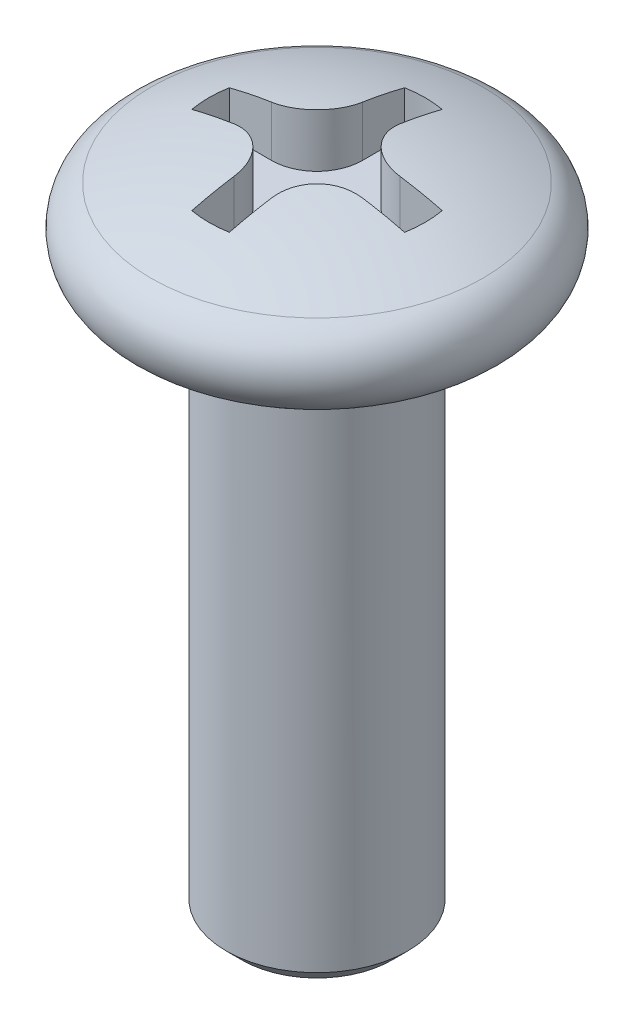
ISO-10303-21;
HEADER;
FILE_DESCRIPTION(('STEP AP214'),'2;1');
FILE_NAME('part.step','',(''),(''),'','','');
FILE_SCHEMA(('AUTOMOTIVE_DESIGN { 1 0 10303 214 1 1 1 1 }'));
ENDSEC;
DATA;
#1=APPLICATION_CONTEXT('core data for automotive mechanical design processes');
#2=APPLICATION_PROTOCOL_DEFINITION('international standard','automotive_design',2000,#1);
#3=PRODUCT_CONTEXT('',#1,'mechanical');
#4=PRODUCT('Part','Part','',(#3));
#5=PRODUCT_RELATED_PRODUCT_CATEGORY('part','',(#4));
#6=PRODUCT_DEFINITION_FORMATION('','',#4);
#7=PRODUCT_DEFINITION_CONTEXT('part definition',#1,'design');
#8=PRODUCT_DEFINITION('design','',#6,#7);
#9=PRODUCT_DEFINITION_SHAPE('','',#8);
#10=(LENGTH_UNIT() NAMED_UNIT(*) SI_UNIT(.MILLI.,.METRE.));
#11=(NAMED_UNIT(*) PLANE_ANGLE_UNIT() SI_UNIT($,.RADIAN.));
#12=(NAMED_UNIT(*) SI_UNIT($,.STERADIAN.) SOLID_ANGLE_UNIT());
#13=UNCERTAINTY_MEASURE_WITH_UNIT(LENGTH_MEASURE(1.E-05),#10,'distance_accuracy_value','');
#14=(GEOMETRIC_REPRESENTATION_CONTEXT(3) GLOBAL_UNCERTAINTY_ASSIGNED_CONTEXT((#13)) GLOBAL_UNIT_ASSIGNED_CONTEXT((#10,
#11,#12)) REPRESENTATION_CONTEXT('',''));
#15=CARTESIAN_POINT('',(0.,0.,0.));
#16=DIRECTION('',(0.,0.,1.));
#17=DIRECTION('',(1.,0.,0.));
#18=AXIS2_PLACEMENT_3D('',#15,#16,#17);
#19=CARTESIAN_POINT('',(0.,0.8,0.));
#20=DIRECTION('',(0.,-1.,0.));
#21=DIRECTION('',(0.,0.,-1.));
#22=AXIS2_PLACEMENT_3D('',#19,#20,#21);
#23=PLANE('',#22);
#24=DIRECTION('',(0.,0.,1.));
#25=VECTOR('',#24,1.);
#26=CARTESIAN_POINT('',(-0.2692388155425,0.8,1.526437178598));
#27=LINE('',#26,#25);
#28=CARTESIAN_POINT('',(-0.2692388155425,0.8,0.9192388155425));
#29=VERTEX_POINT('',#28);
#30=CARTESIAN_POINT('',(-0.2692388155425,0.8,1.52643717859784));
#31=VERTEX_POINT('',#30);
#32=EDGE_CURVE('E158',#29,#31,#27,.T.);
#33=ORIENTED_EDGE('',*,*,#32,.T.);
#34=CARTESIAN_POINT('',(0.,0.8,0.));
#35=DIRECTION('',(0.,-1.,0.));
#36=DIRECTION('',(0.,0.,-1.));
#37=AXIS2_PLACEMENT_3D('',#34,#35,#36);
#38=CIRCLE('',#37,1.55);
#39=CARTESIAN_POINT('',(0.269238815542473,0.8,1.52643717859769));
#40=VERTEX_POINT('',#39);
#41=EDGE_CURVE('E230',#31,#40,#38,.F.);
#42=ORIENTED_EDGE('',*,*,#41,.T.);
#43=DIRECTION('',(0.,0.,-1.));
#44=VECTOR('',#43,1.);
#45=CARTESIAN_POINT('',(0.2692388155425,0.8,0.9192388155425));
#46=LINE('',#45,#44);
#47=CARTESIAN_POINT('',(0.2692388155425,0.8,0.9192388155425));
#48=VERTEX_POINT('',#47);
#49=EDGE_CURVE('E162',#40,#48,#46,.T.);
#50=ORIENTED_EDGE('',*,*,#49,.T.);
#51=CARTESIAN_POINT('',(0.9192388155425,0.8,0.9192388155425));
#52=DIRECTION('',(0.,-1.,0.));
#53=DIRECTION('',(0.,0.,-1.));
#54=AXIS2_PLACEMENT_3D('',#51,#52,#53);
#55=CIRCLE('',#54,0.65);
#56=CARTESIAN_POINT('',(0.9192388155425,0.8,0.2692388155425));
#57=VERTEX_POINT('',#56);
#58=EDGE_CURVE('E165',#57,#48,#55,.F.);
#59=ORIENTED_EDGE('',*,*,#58,.F.);
#60=DIRECTION('',(1.,0.,0.));
#61=VECTOR('',#60,1.);
#62=CARTESIAN_POINT('',(1.526437178598,0.8,0.2692388155425));
#63=LINE('',#62,#61);
#64=CARTESIAN_POINT('',(1.52643717859784,0.8,0.2692388155425));
#65=VERTEX_POINT('',#64);
#66=EDGE_CURVE('E166',#57,#65,#63,.T.);
#67=ORIENTED_EDGE('',*,*,#66,.T.);
#68=CARTESIAN_POINT('',(0.,0.8,0.));
#69=DIRECTION('',(0.,-1.,0.));
#70=DIRECTION('',(0.,0.,-1.));
#71=AXIS2_PLACEMENT_3D('',#68,#69,#70);
#72=CIRCLE('',#71,1.55);
#73=CARTESIAN_POINT('',(1.52643717859769,0.8,-0.269238815542473));
#74=VERTEX_POINT('',#73);
#75=EDGE_CURVE('E241',#65,#74,#72,.F.);
#76=ORIENTED_EDGE('',*,*,#75,.T.);
#77=DIRECTION('',(-1.,0.,0.));
#78=VECTOR('',#77,1.);
#79=CARTESIAN_POINT('',(0.9192388155425,0.8,-0.2692388155425));
#80=LINE('',#79,#78);
#81=CARTESIAN_POINT('',(0.9192388155425,0.8,-0.2692388155425));
#82=VERTEX_POINT('',#81);
#83=EDGE_CURVE('E170',#74,#82,#80,.T.);
#84=ORIENTED_EDGE('',*,*,#83,.T.);
#85=CARTESIAN_POINT('',(0.9192388155425,0.8,-0.9192388155425));
#86=DIRECTION('',(0.,-1.,0.));
#87=DIRECTION('',(0.,0.,-1.));
#88=AXIS2_PLACEMENT_3D('',#85,#86,#87);
#89=CIRCLE('',#88,0.65);
#90=CARTESIAN_POINT('',(0.2692388155425,0.8,-0.9192388155425));
#91=VERTEX_POINT('',#90);
#92=EDGE_CURVE('E173',#91,#82,#89,.F.);
#93=ORIENTED_EDGE('',*,*,#92,.F.);
#94=DIRECTION('',(0.,0.,-1.));
#95=VECTOR('',#94,1.);
#96=CARTESIAN_POINT('',(0.2692388155425,0.8,-1.526437178598));
#97=LINE('',#96,#95);
#98=CARTESIAN_POINT('',(0.2692388155425,0.8,-1.52643717859784));
#99=VERTEX_POINT('',#98);
#100=EDGE_CURVE('E175',#91,#99,#97,.T.);
#101=ORIENTED_EDGE('',*,*,#100,.T.);
#102=CARTESIAN_POINT('',(0.,0.8,0.));
#103=DIRECTION('',(0.,-1.,0.));
#104=DIRECTION('',(0.,0.,-1.));
#105=AXIS2_PLACEMENT_3D('',#102,#103,#104);
#106=CIRCLE('',#105,1.55);
#107=CARTESIAN_POINT('',(-0.269238815542474,0.8,-1.52643717859769));
#108=VERTEX_POINT('',#107);
#109=EDGE_CURVE('E134',#99,#108,#106,.F.);
#110=ORIENTED_EDGE('',*,*,#109,.T.);
#111=DIRECTION('',(0.,0.,1.));
#112=VECTOR('',#111,1.);
#113=CARTESIAN_POINT('',(-0.2692388155425,0.8,-0.9192388155425));
#114=LINE('',#113,#112);
#115=CARTESIAN_POINT('',(-0.2692388155425,0.8,-0.9192388155425));
#116=VERTEX_POINT('',#115);
#117=EDGE_CURVE('E130',#108,#116,#114,.T.);
#118=ORIENTED_EDGE('',*,*,#117,.T.);
#119=CARTESIAN_POINT('',(-0.9192388155425,0.8,-0.9192388155425));
#120=DIRECTION('',(0.,-1.,0.));
#121=DIRECTION('',(0.,0.,-1.));
#122=AXIS2_PLACEMENT_3D('',#119,#120,#121);
#123=CIRCLE('',#122,0.65);
#124=CARTESIAN_POINT('',(-0.9192388155425,0.8,-0.2692388155425));
#125=VERTEX_POINT('',#124);
#126=EDGE_CURVE('E18',#125,#116,#123,.F.);
#127=ORIENTED_EDGE('',*,*,#126,.F.);
#128=DIRECTION('',(-1.,0.,0.));
#129=VECTOR('',#128,1.);
#130=CARTESIAN_POINT('',(-1.526437178598,0.8,-0.2692388155425));
#131=LINE('',#130,#129);
#132=CARTESIAN_POINT('',(-1.52643717859769,0.8,-0.269238815542473));
#133=VERTEX_POINT('',#132);
#134=EDGE_CURVE('E125',#125,#133,#131,.T.);
#135=ORIENTED_EDGE('',*,*,#134,.T.);
#136=CARTESIAN_POINT('',(0.,0.8,0.));
#137=DIRECTION('',(0.,-1.,0.));
#138=DIRECTION('',(0.,0.,-1.));
#139=AXIS2_PLACEMENT_3D('',#136,#137,#138);
#140=CIRCLE('',#139,1.55);
#141=CARTESIAN_POINT('',(-1.52643717859784,0.8,0.2692388155425));
#142=VERTEX_POINT('',#141);
#143=EDGE_CURVE('E238',#133,#142,#140,.F.);
#144=ORIENTED_EDGE('',*,*,#143,.T.);
#145=DIRECTION('',(1.,0.,0.));
#146=VECTOR('',#145,1.);
#147=CARTESIAN_POINT('',(-0.9192388155425,0.8,0.2692388155425));
#148=LINE('',#147,#146);
#149=CARTESIAN_POINT('',(-0.9192388155425,0.8,0.2692388155425));
#150=VERTEX_POINT('',#149);
#151=EDGE_CURVE('E155',#142,#150,#148,.T.);
#152=ORIENTED_EDGE('',*,*,#151,.T.);
#153=CARTESIAN_POINT('',(-0.9192388155425,0.8,0.9192388155425));
#154=DIRECTION('',(0.,-1.,0.));
#155=DIRECTION('',(0.,0.,-1.));
#156=AXIS2_PLACEMENT_3D('',#153,#154,#155);
#157=CIRCLE('',#156,0.65);
#158=EDGE_CURVE('E224',#29,#150,#157,.F.);
#159=ORIENTED_EDGE('',*,*,#158,.F.);
#160=EDGE_LOOP('',(#33,#42,#50,#59,#67,#76,#84,#93,#101,#110,#118,#127,#135,#144,#152,#159));
#161=FACE_BOUND('',#160,.T.);
#162=ADVANCED_FACE('F15',(#161),#23,.F.);
#163=CARTESIAN_POINT('',(-1.526437178598,0.8,-0.2692388155425));
#164=DIRECTION('',(0.,0.,-1.));
#165=DIRECTION('',(-1.,0.,0.));
#166=AXIS2_PLACEMENT_3D('',#163,#164,#165);
#167=PLANE('',#166);
#168=ORIENTED_EDGE('',*,*,#134,.F.);
#169=DIRECTION('',(0.,-1.,0.));
#170=VECTOR('',#169,1.);
#171=CARTESIAN_POINT('',(-0.9192388155425,0.8,-0.2692388155425));
#172=LINE('',#171,#170);
#173=CARTESIAN_POINT('',(-0.919238815542485,1.5247137721749,-0.269238815542501));
#174=VERTEX_POINT('',#173);
#175=EDGE_CURVE('E144',#174,#125,#172,.T.);
#176=ORIENTED_EDGE('',*,*,#175,.F.);
#177=CARTESIAN_POINT('',(-1.52643717859784,1.40083405534686,-0.269238815542502));
#178=CARTESIAN_POINT('',(-1.42628258533272,1.42660341497324,-0.269238815542501));
#179=CARTESIAN_POINT('',(-1.3256054251122,1.44981140452209,-0.2692388155425));
#180=CARTESIAN_POINT('',(-1.12320597076041,1.49110464346474,-0.2692388155425));
#181=CARTESIAN_POINT('',(-1.02148367662913,1.50918989285854,-0.269238815542501));
#182=CARTESIAN_POINT('',(-0.919238815542471,1.52471377217481,-0.269238815542503));
#183=B_SPLINE_CURVE_WITH_KNOTS('',3,(#177,#178,#179,#180,#181,#182),.UNSPECIFIED.,.F.,.F.,(4,2,
4),(0.,0.309952435577939,0.619904871155877),.UNSPECIFIED.);
#184=CARTESIAN_POINT('',(-1.52643717859777,1.40083405534693,-0.269238815542474));
#185=VERTEX_POINT('',#184);
#186=EDGE_CURVE('E221',#185,#174,#183,.T.);
#187=ORIENTED_EDGE('',*,*,#186,.F.);
#188=DIRECTION('',(0.,-1.,0.));
#189=VECTOR('',#188,1.);
#190=CARTESIAN_POINT('',(-1.5264371785977,0.8,-0.269238815542447));
#191=LINE('',#190,#189);
#192=EDGE_CURVE('E236',#185,#133,#191,.T.);
#193=ORIENTED_EDGE('',*,*,#192,.T.);
#194=EDGE_LOOP('',(#168,#176,#187,#193));
#195=FACE_BOUND('',#194,.T.);
#196=ADVANCED_FACE('F279',(#195),#167,.F.);
#197=CARTESIAN_POINT('',(-0.9192388155425,0.8,-0.9192388155425));
#198=DIRECTION('',(0.,-1.,0.));
#199=DIRECTION('',(0.,0.,-1.));
#200=AXIS2_PLACEMENT_3D('',#197,#198,#199);
#201=CYLINDRICAL_SURFACE('',#200,0.65);
#202=DIRECTION('',(0.,1.,0.));
#203=VECTOR('',#202,1.);
#204=CARTESIAN_POINT('',(-0.2692388155425,0.8,-0.9192388155425));
#205=LINE('',#204,#203);
#206=CARTESIAN_POINT('',(-0.269238815542499,1.5247137721749,-0.9192388155425));
#207=VERTEX_POINT('',#206);
#208=EDGE_CURVE('E138',#116,#207,#205,.T.);
#209=ORIENTED_EDGE('',*,*,#208,.T.);
#210=CARTESIAN_POINT('',(-0.919238815542471,1.52471377217481,-0.269238815542502));
#211=CARTESIAN_POINT('',(-0.883271069284547,1.53017838215662,-0.269206596368221));
#212=CARTESIAN_POINT('',(-0.847230957030022,1.53518398680924,-0.272222835690411));
#213=CARTESIAN_POINT('',(-0.776024482266567,1.54415362187526,-0.284194183766013));
#214=CARTESIAN_POINT('',(-0.740857976412674,1.5481178242021,-0.293148311438722));
#215=CARTESIAN_POINT('',(-0.67237147630745,1.55488625546089,-0.316848960302737));
#216=CARTESIAN_POINT('',(-0.639053304502208,1.55768935656103,-0.331601086387425));
#217=CARTESIAN_POINT('',(-0.575297778798748,1.56204492956572,-0.366496760027211));
#218=CARTESIAN_POINT('',(-0.544859240050173,1.56359791783258,-0.386638076978003));
#219=CARTESIAN_POINT('',(-0.488097063461274,1.56539571440067,-0.431479043245953));
#220=CARTESIAN_POINT('',(-0.46172860298219,1.56565593228317,-0.456121349806758));
#221=CARTESIAN_POINT('',(-0.413435525795813,1.56490196217992,-0.509414647326526));
#222=CARTESIAN_POINT('',(-0.391510799474461,1.56388780563375,-0.538065539375813));
#223=CARTESIAN_POINT('',(-0.352825154531402,1.56062536432746,-0.598376464130783));
#224=CARTESIAN_POINT('',(-0.33603703253758,1.55838376285363,-0.630019440211363));
#225=CARTESIAN_POINT('',(-0.307904881496572,1.55273696196925,-0.69554063304805));
#226=CARTESIAN_POINT('',(-0.296559537832556,1.54933204387991,-0.729418307797173));
#227=CARTESIAN_POINT('',(-0.281799832125994,1.54249219211062,-0.789390970708275));
#228=CARTESIAN_POINT('',(-0.277087023520738,1.53929822937966,-0.815202930682549));
#229=CARTESIAN_POINT('',(-0.270805742102409,1.53238664939424,-0.867099473917435));
#230=CARTESIAN_POINT('',(-0.269232761212042,1.52866979112439,-0.893183612184108));
#231=CARTESIAN_POINT('',(-0.269238815542499,1.5247137721748,-0.919238815542471));
#232=B_SPLINE_CURVE_WITH_KNOTS('',3,(#210,#211,#212,#213,#214,#215,#216,#217,#218,#219,#220,
#221,#222,#223,#224,#225,#226,#227,#228,#229,#230,#231),.UNSPECIFIED.,.F.,.F.,(4,2,2,2,2,2,2,2,
2,2,4),(0.,0.109017930799935,0.218017853725243,0.327123406477721,0.436183869743588,
0.543941180487167,0.651695832846214,0.758869525629321,0.866017319256542,0.945129051904781,
1.02412711619082),.UNSPECIFIED.);
#233=EDGE_CURVE('E263',#174,#207,#232,.T.);
#234=ORIENTED_EDGE('',*,*,#233,.F.);
#235=ORIENTED_EDGE('',*,*,#175,.T.);
#236=ORIENTED_EDGE('',*,*,#126,.T.);
#237=EDGE_LOOP('',(#209,#234,#235,#236));
#238=FACE_BOUND('',#237,.T.);
#239=ADVANCED_FACE('F141',(#238),#201,.T.);
#240=CARTESIAN_POINT('',(-0.2692388155425,0.8,-0.9192388155425));
#241=DIRECTION('',(-1.,0.,0.));
#242=DIRECTION('',(0.,0.,1.));
#243=AXIS2_PLACEMENT_3D('',#240,#241,#242);
#244=PLANE('',#243);
#245=ORIENTED_EDGE('',*,*,#117,.F.);
#246=DIRECTION('',(0.,-1.,0.));
#247=VECTOR('',#246,1.);
#248=CARTESIAN_POINT('',(-0.269238815542447,0.8,-1.5264371785977));
#249=LINE('',#248,#247);
#250=CARTESIAN_POINT('',(-0.269238815542499,1.40083405534695,-1.5264371785976));
#251=VERTEX_POINT('',#250);
#252=EDGE_CURVE('E150',#108,#251,#249,.F.);
#253=ORIENTED_EDGE('',*,*,#252,.T.);
#254=CARTESIAN_POINT('',(-0.269238815542499,-4.530985590341,0.));
#255=DIRECTION('',(-1.,0.,0.));
#256=DIRECTION('',(0.,0.,1.));
#257=AXIS2_PLACEMENT_3D('',#254,#255,#256);
#258=CIRCLE('',#257,6.12507100115372);
#259=EDGE_CURVE('E147',#207,#251,#258,.T.);
#260=ORIENTED_EDGE('',*,*,#259,.F.);
#261=ORIENTED_EDGE('',*,*,#208,.F.);
#262=EDGE_LOOP('',(#245,#253,#260,#261));
#263=FACE_BOUND('',#262,.T.);
#264=ADVANCED_FACE('F145',(#263),#244,.F.);
#265=CARTESIAN_POINT('',(0.,0.8,0.));
#266=DIRECTION('',(0.,-1.,0.));
#267=DIRECTION('',(0.,0.,-1.));
#268=AXIS2_PLACEMENT_3D('',#265,#266,#267);
#269=CYLINDRICAL_SURFACE('',#268,1.55);
#270=ORIENTED_EDGE('',*,*,#109,.F.);
#271=DIRECTION('',(0.,1.,0.));
#272=VECTOR('',#271,1.);
#273=CARTESIAN_POINT('',(0.2692388155425,0.8,-1.526437178598));
#274=LINE('',#273,#272);
#275=CARTESIAN_POINT('',(0.2692388155425,1.40083405534691,-1.52643717859775));
#276=VERTEX_POINT('',#275);
#277=EDGE_CURVE('E176',#99,#276,#274,.T.);
#278=ORIENTED_EDGE('',*,*,#277,.T.);
#279=CARTESIAN_POINT('',(0.,1.400834055347,0.));
#280=DIRECTION('',(0.,-1.,0.));
#281=DIRECTION('',(0.,0.,-1.));
#282=AXIS2_PLACEMENT_3D('',#279,#280,#281);
#283=CIRCLE('',#282,1.55);
#284=EDGE_CURVE('E251',#251,#276,#283,.T.);
#285=ORIENTED_EDGE('',*,*,#284,.F.);
#286=ORIENTED_EDGE('',*,*,#252,.F.);
#287=EDGE_LOOP('',(#270,#278,#285,#286));
#288=FACE_BOUND('',#287,.T.);
#289=ADVANCED_FACE('F249',(#288),#269,.F.);
#290=CARTESIAN_POINT('',(0.2692388155425,0.8,-1.526437178598));
#291=DIRECTION('',(1.,0.,0.));
#292=DIRECTION('',(0.,0.,-1.));
#293=AXIS2_PLACEMENT_3D('',#290,#291,#292);
#294=PLANE('',#293);
#295=ORIENTED_EDGE('',*,*,#100,.F.);
#296=DIRECTION('',(0.,-1.,0.));
#297=VECTOR('',#296,1.);
#298=CARTESIAN_POINT('',(0.2692388155425,0.8,-0.9192388155425));
#299=LINE('',#298,#297);
#300=CARTESIAN_POINT('',(0.2692388155425,1.5247137721749,-0.9192388155425));
#301=VERTEX_POINT('',#300);
#302=EDGE_CURVE('E243',#301,#91,#299,.T.);
#303=ORIENTED_EDGE('',*,*,#302,.F.);
#304=CARTESIAN_POINT('',(0.2692388155425,-4.530985590341,0.));
#305=DIRECTION('',(-1.,0.,0.));
#306=DIRECTION('',(0.,0.,1.));
#307=AXIS2_PLACEMENT_3D('',#304,#305,#306);
#308=CIRCLE('',#307,6.12507100115372);
#309=EDGE_CURVE('E254',#276,#301,#308,.F.);
#310=ORIENTED_EDGE('',*,*,#309,.F.);
#311=ORIENTED_EDGE('',*,*,#277,.F.);
#312=EDGE_LOOP('',(#295,#303,#310,#311));
#313=FACE_BOUND('',#312,.T.);
#314=ADVANCED_FACE('F255',(#313),#294,.F.);
#315=CARTESIAN_POINT('',(0.9192388155425,0.8,-0.9192388155425));
#316=DIRECTION('',(0.,-1.,0.));
#317=DIRECTION('',(0.,0.,-1.));
#318=AXIS2_PLACEMENT_3D('',#315,#316,#317);
#319=CYLINDRICAL_SURFACE('',#318,0.65);
#320=DIRECTION('',(0.,1.,0.));
#321=VECTOR('',#320,1.);
#322=CARTESIAN_POINT('',(0.9192388155425,0.8,-0.2692388155425));
#323=LINE('',#322,#321);
#324=CARTESIAN_POINT('',(0.919238815542485,1.5247137721749,-0.269238815542501));
#325=VERTEX_POINT('',#324);
#326=EDGE_CURVE('E172',#82,#325,#323,.T.);
#327=ORIENTED_EDGE('',*,*,#326,.T.);
#328=CARTESIAN_POINT('',(0.2692388155425,1.5247137721748,-0.919238815542471));
#329=CARTESIAN_POINT('',(0.26920659636822,1.53017838215662,-0.883271069284549));
#330=CARTESIAN_POINT('',(0.27222283569041,1.53518398680924,-0.847230957030025));
#331=CARTESIAN_POINT('',(0.284194183766012,1.54415362187526,-0.776024482266574));
#332=CARTESIAN_POINT('',(0.29314831143872,1.5481178242021,-0.740857976412682));
#333=CARTESIAN_POINT('',(0.316848960302734,1.55488625546089,-0.672371476307461));
#334=CARTESIAN_POINT('',(0.33160108638742,1.55768935656103,-0.63905330450222));
#335=CARTESIAN_POINT('',(0.366496760027202,1.56204492956572,-0.575297778798761));
#336=CARTESIAN_POINT('',(0.386638076977991,1.56359791783258,-0.544859240050187));
#337=CARTESIAN_POINT('',(0.431479043245938,1.56539571440067,-0.488097063461288));
#338=CARTESIAN_POINT('',(0.456121349806743,1.56565593228317,-0.461728602982204));
#339=CARTESIAN_POINT('',(0.509414647326511,1.56490196217992,-0.413435525795826));
#340=CARTESIAN_POINT('',(0.538065539375799,1.56388780563376,-0.391510799474473));
#341=CARTESIAN_POINT('',(0.598376464130768,1.56062536432746,-0.352825154531412));
#342=CARTESIAN_POINT('',(0.630019440211347,1.55838376285363,-0.336037032537589));
#343=CARTESIAN_POINT('',(0.695540633048032,1.55273696196925,-0.307904881496577));
#344=CARTESIAN_POINT('',(0.729418307797154,1.54933204387992,-0.296559537832559));
#345=CARTESIAN_POINT('',(0.789390970708259,1.54249219211062,-0.281799832125995));
#346=CARTESIAN_POINT('',(0.815202930682536,1.53929822937967,-0.277087023520739));
#347=CARTESIAN_POINT('',(0.867099473917428,1.53238664939424,-0.270805742102411));
#348=CARTESIAN_POINT('',(0.893183612184104,1.52866979112439,-0.269232761212043));
#349=CARTESIAN_POINT('',(0.91923881554247,1.52471377217481,-0.269238815542501));
#350=B_SPLINE_CURVE_WITH_KNOTS('',3,(#328,#329,#330,#331,#332,#333,#334,#335,#336,#337,#338,
#339,#340,#341,#342,#343,#344,#345,#346,#347,#348,#349),.UNSPECIFIED.,.F.,.F.,(4,2,2,2,2,2,2,2,
2,2,4),(0.,0.10901793079993,0.218017853725233,0.327123406477707,0.436183869743568,
0.543941180487147,0.651695832846195,0.758869525629303,0.866017319256523,0.945129051904771,
1.02412711619082),.UNSPECIFIED.);
#351=EDGE_CURVE('E259',#301,#325,#350,.T.);
#352=ORIENTED_EDGE('',*,*,#351,.F.);
#353=ORIENTED_EDGE('',*,*,#302,.T.);
#354=ORIENTED_EDGE('',*,*,#92,.T.);
#355=EDGE_LOOP('',(#327,#352,#353,#354));
#356=FACE_BOUND('',#355,.T.);
#357=ADVANCED_FACE('F398',(#356),#319,.T.);
#358=CARTESIAN_POINT('',(0.9192388155425,0.8,-0.2692388155425));
#359=DIRECTION('',(0.,0.,-1.));
#360=DIRECTION('',(-1.,0.,0.));
#361=AXIS2_PLACEMENT_3D('',#358,#359,#360);
#362=PLANE('',#361);
#363=ORIENTED_EDGE('',*,*,#83,.F.);
#364=DIRECTION('',(0.,-1.,0.));
#365=VECTOR('',#364,1.);
#366=CARTESIAN_POINT('',(1.5264371785977,0.8,-0.269238815542447));
#367=LINE('',#366,#365);
#368=CARTESIAN_POINT('',(1.52643717859769,1.400834055347,-0.269238815542473));
#369=VERTEX_POINT('',#368);
#370=EDGE_CURVE('E169',#74,#369,#367,.F.);
#371=ORIENTED_EDGE('',*,*,#370,.T.);
#372=CARTESIAN_POINT('',(0.91923881554247,1.52471377217481,-0.269238815542502));
#373=CARTESIAN_POINT('',(1.02148367662913,1.50918989285854,-0.269238815542501));
#374=CARTESIAN_POINT('',(1.12320597076041,1.49110464346474,-0.2692388155425));
#375=CARTESIAN_POINT('',(1.3256054251122,1.44981140452209,-0.2692388155425));
#376=CARTESIAN_POINT('',(1.42628258533272,1.42660341497324,-0.269238815542501));
#377=CARTESIAN_POINT('',(1.52643717859784,1.40083405534686,-0.269238815542503));
#378=B_SPLINE_CURVE_WITH_KNOTS('',3,(#372,#373,#374,#375,#376,#377),.UNSPECIFIED.,.F.,.F.,(4,2,
4),(0.,0.309952435577939,0.619904871155879),.UNSPECIFIED.);
#379=EDGE_CURVE('E504',#325,#369,#378,.T.);
#380=ORIENTED_EDGE('',*,*,#379,.F.);
#381=ORIENTED_EDGE('',*,*,#326,.F.);
#382=EDGE_LOOP('',(#363,#371,#380,#381));
#383=FACE_BOUND('',#382,.T.);
#384=ADVANCED_FACE('F390',(#383),#362,.F.);
#385=CARTESIAN_POINT('',(0.,0.8,0.));
#386=DIRECTION('',(0.,-1.,0.));
#387=DIRECTION('',(0.,0.,-1.));
#388=AXIS2_PLACEMENT_3D('',#385,#386,#387);
#389=CYLINDRICAL_SURFACE('',#388,1.55);
#390=ORIENTED_EDGE('',*,*,#143,.F.);
#391=ORIENTED_EDGE('',*,*,#192,.F.);
#392=CARTESIAN_POINT('',(0.,1.400834055347,0.));
#393=DIRECTION('',(0.,-1.,0.));
#394=DIRECTION('',(0.,0.,-1.));
#395=AXIS2_PLACEMENT_3D('',#392,#393,#394);
#396=CIRCLE('',#395,1.55);
#397=CARTESIAN_POINT('',(-1.52643717859784,1.400834055347,0.2692388155425));
#398=VERTEX_POINT('',#397);
#399=EDGE_CURVE('E510',#398,#185,#396,.T.);
#400=ORIENTED_EDGE('',*,*,#399,.F.);
#401=DIRECTION('',(0.,1.,0.));
#402=VECTOR('',#401,1.);
#403=CARTESIAN_POINT('',(-1.526437178598,0.8,0.2692388155425));
#404=LINE('',#403,#402);
#405=EDGE_CURVE('E157',#398,#142,#404,.F.);
#406=ORIENTED_EDGE('',*,*,#405,.T.);
#407=EDGE_LOOP('',(#390,#391,#400,#406));
#408=FACE_BOUND('',#407,.T.);
#409=ADVANCED_FACE('F382',(#408),#389,.F.);
#410=CARTESIAN_POINT('',(0.,0.8,0.));
#411=DIRECTION('',(0.,-1.,0.));
#412=DIRECTION('',(0.,0.,-1.));
#413=AXIS2_PLACEMENT_3D('',#410,#411,#412);
#414=CYLINDRICAL_SURFACE('',#413,1.55);
#415=ORIENTED_EDGE('',*,*,#370,.F.);
#416=ORIENTED_EDGE('',*,*,#75,.F.);
#417=DIRECTION('',(0.,1.,0.));
#418=VECTOR('',#417,1.);
#419=CARTESIAN_POINT('',(1.526437178598,0.8,0.2692388155425));
#420=LINE('',#419,#418);
#421=CARTESIAN_POINT('',(1.52643717859795,1.40083405534692,0.269238815542498));
#422=VERTEX_POINT('',#421);
#423=EDGE_CURVE('E168',#65,#422,#420,.T.);
#424=ORIENTED_EDGE('',*,*,#423,.T.);
#425=CARTESIAN_POINT('',(0.,1.400834055347,0.));
#426=DIRECTION('',(0.,-1.,0.));
#427=DIRECTION('',(0.,0.,-1.));
#428=AXIS2_PLACEMENT_3D('',#425,#426,#427);
#429=CIRCLE('',#428,1.55);
#430=EDGE_CURVE('E512',#369,#422,#429,.T.);
#431=ORIENTED_EDGE('',*,*,#430,.F.);
#432=EDGE_LOOP('',(#415,#416,#424,#431));
#433=FACE_BOUND('',#432,.T.);
#434=ADVANCED_FACE('F374',(#433),#414,.F.);
#435=CARTESIAN_POINT('',(1.526437178598,0.8,0.2692388155425));
#436=DIRECTION('',(0.,0.,1.));
#437=DIRECTION('',(1.,0.,0.));
#438=AXIS2_PLACEMENT_3D('',#435,#436,#437);
#439=PLANE('',#438);
#440=ORIENTED_EDGE('',*,*,#66,.F.);
#441=DIRECTION('',(0.,-1.,0.));
#442=VECTOR('',#441,1.);
#443=CARTESIAN_POINT('',(0.9192388155425,0.8,0.2692388155425));
#444=LINE('',#443,#442);
#445=CARTESIAN_POINT('',(0.919238815542485,1.5247137721749,0.269238815542499));
#446=VERTEX_POINT('',#445);
#447=EDGE_CURVE('E232',#446,#57,#444,.T.);
#448=ORIENTED_EDGE('',*,*,#447,.F.);
#449=CARTESIAN_POINT('',(1.5264371785979,1.40083405534685,0.269238815542497));
#450=CARTESIAN_POINT('',(1.42628258533276,1.42660341497323,0.269238815542499));
#451=CARTESIAN_POINT('',(1.32560542511224,1.44981140452209,0.2692388155425));
#452=CARTESIAN_POINT('',(1.12320597076043,1.49110464346474,0.2692388155425));
#453=CARTESIAN_POINT('',(1.02148367662914,1.50918989285854,0.269238815542499));
#454=CARTESIAN_POINT('',(0.91923881554247,1.52471377217481,0.269238815542498));
#455=B_SPLINE_CURVE_WITH_KNOTS('',3,(#449,#450,#451,#452,#453,#454),.UNSPECIFIED.,.F.,.F.,(4,2,
4),(0.,0.309952435577969,0.619904871155937),.UNSPECIFIED.);
#456=EDGE_CURVE('E514',#422,#446,#455,.T.);
#457=ORIENTED_EDGE('',*,*,#456,.F.);
#458=ORIENTED_EDGE('',*,*,#423,.F.);
#459=EDGE_LOOP('',(#440,#448,#457,#458));
#460=FACE_BOUND('',#459,.T.);
#461=ADVANCED_FACE('F366',(#460),#439,.F.);
#462=CARTESIAN_POINT('',(0.9192388155425,0.8,0.9192388155425));
#463=DIRECTION('',(0.,-1.,0.));
#464=DIRECTION('',(0.,0.,-1.));
#465=AXIS2_PLACEMENT_3D('',#462,#463,#464);
#466=CYLINDRICAL_SURFACE('',#465,0.65);
#467=DIRECTION('',(0.,1.,0.));
#468=VECTOR('',#467,1.);
#469=CARTESIAN_POINT('',(0.2692388155425,0.8,0.9192388155425));
#470=LINE('',#469,#468);
#471=CARTESIAN_POINT('',(0.2692388155425,1.5247137721749,0.9192388155425));
#472=VERTEX_POINT('',#471);
#473=EDGE_CURVE('E164',#48,#472,#470,.T.);
#474=ORIENTED_EDGE('',*,*,#473,.T.);
#475=CARTESIAN_POINT('',(0.91923881554247,1.52471377217481,0.269238815542498));
#476=CARTESIAN_POINT('',(0.883271069284547,1.53017838215662,0.269206596368219));
#477=CARTESIAN_POINT('',(0.847230957030021,1.53518398680924,0.27222283569041));
#478=CARTESIAN_POINT('',(0.776024482266567,1.54415362187526,0.284194183766014));
#479=CARTESIAN_POINT('',(0.740857976412673,1.5481178242021,0.293148311438724));
#480=CARTESIAN_POINT('',(0.67237147630745,1.55488625546089,0.316848960302739));
#481=CARTESIAN_POINT('',(0.639053304502207,1.55768935656103,0.331601086387426));
#482=CARTESIAN_POINT('',(0.575297778798747,1.56204492956572,0.36649676002721));
#483=CARTESIAN_POINT('',(0.544859240050172,1.56359791783258,0.386638076978001));
#484=CARTESIAN_POINT('',(0.488097063461273,1.56539571440067,0.43147904324595));
#485=CARTESIAN_POINT('',(0.461728602982189,1.56565593228317,0.456121349806757));
#486=CARTESIAN_POINT('',(0.413435525795813,1.56490196217992,0.509414647326527));
#487=CARTESIAN_POINT('',(0.39151079947446,1.56388780563376,0.538065539375815));
#488=CARTESIAN_POINT('',(0.352825154531401,1.56062536432746,0.598376464130786));
#489=CARTESIAN_POINT('',(0.336037032537579,1.55838376285363,0.630019440211365));
#490=CARTESIAN_POINT('',(0.307904881496571,1.55273696196925,0.695540633048051));
#491=CARTESIAN_POINT('',(0.296559537832556,1.54933204387991,0.729418307797174));
#492=CARTESIAN_POINT('',(0.281799832125994,1.54249219211062,0.789390970708276));
#493=CARTESIAN_POINT('',(0.277087023520738,1.53929822937966,0.815202930682551));
#494=CARTESIAN_POINT('',(0.270805742102409,1.53238664939424,0.867099473917437));
#495=CARTESIAN_POINT('',(0.269232761212041,1.52866979112439,0.89318361218411));
#496=CARTESIAN_POINT('',(0.2692388155425,1.5247137721748,0.919238815542473));
#497=B_SPLINE_CURVE_WITH_KNOTS('',3,(#475,#476,#477,#478,#479,#480,#481,#482,#483,#484,#485,
#486,#487,#488,#489,#490,#491,#492,#493,#494,#495,#496),.UNSPECIFIED.,.F.,.F.,(4,2,2,2,2,2,2,2,
2,2,4),(0.,0.109017930799935,0.218017853725244,0.327123406477721,0.436183869743587,
0.543941180487167,0.651695832846216,0.758869525629322,0.866017319256542,0.945129051904782,
1.02412711619082),.UNSPECIFIED.);
#498=EDGE_CURVE('E520',#446,#472,#497,.T.);
#499=ORIENTED_EDGE('',*,*,#498,.F.);
#500=ORIENTED_EDGE('',*,*,#447,.T.);
#501=ORIENTED_EDGE('',*,*,#58,.T.);
#502=EDGE_LOOP('',(#474,#499,#500,#501));
#503=FACE_BOUND('',#502,.T.);
#504=ADVANCED_FACE('F358',(#503),#466,.T.);
#505=CARTESIAN_POINT('',(0.2692388155425,0.8,0.9192388155425));
#506=DIRECTION('',(1.,0.,0.));
#507=DIRECTION('',(0.,0.,-1.));
#508=AXIS2_PLACEMENT_3D('',#505,#506,#507);
#509=PLANE('',#508);
#510=ORIENTED_EDGE('',*,*,#49,.F.);
#511=DIRECTION('',(0.,-1.,0.));
#512=VECTOR('',#511,1.);
#513=CARTESIAN_POINT('',(0.269238815542447,0.8,1.5264371785977));
#514=LINE('',#513,#512);
#515=CARTESIAN_POINT('',(0.2692388155425,1.40083405534695,1.5264371785976));
#516=VERTEX_POINT('',#515);
#517=EDGE_CURVE('E161',#40,#516,#514,.F.);
#518=ORIENTED_EDGE('',*,*,#517,.T.);
#519=CARTESIAN_POINT('',(0.2692388155425,-4.530985590341,0.));
#520=DIRECTION('',(-1.,0.,0.));
#521=DIRECTION('',(0.,0.,1.));
#522=AXIS2_PLACEMENT_3D('',#519,#520,#521);
#523=CIRCLE('',#522,6.12507100115372);
#524=EDGE_CURVE('E529',#472,#516,#523,.F.);
#525=ORIENTED_EDGE('',*,*,#524,.F.);
#526=ORIENTED_EDGE('',*,*,#473,.F.);
#527=EDGE_LOOP('',(#510,#518,#525,#526));
#528=FACE_BOUND('',#527,.T.);
#529=ADVANCED_FACE('F350',(#528),#509,.F.);
#530=CARTESIAN_POINT('',(0.,0.8,0.));
#531=DIRECTION('',(0.,-1.,0.));
#532=DIRECTION('',(0.,0.,-1.));
#533=AXIS2_PLACEMENT_3D('',#530,#531,#532);
#534=CYLINDRICAL_SURFACE('',#533,1.55);
#535=ORIENTED_EDGE('',*,*,#41,.F.);
#536=DIRECTION('',(0.,1.,0.));
#537=VECTOR('',#536,1.);
#538=CARTESIAN_POINT('',(-0.2692388155425,0.8,1.526437178598));
#539=LINE('',#538,#537);
#540=CARTESIAN_POINT('',(-0.269238815542499,1.40083405534691,1.52643717859775));
#541=VERTEX_POINT('',#540);
#542=EDGE_CURVE('E160',#31,#541,#539,.T.);
#543=ORIENTED_EDGE('',*,*,#542,.T.);
#544=CARTESIAN_POINT('',(0.,1.400834055347,0.));
#545=DIRECTION('',(0.,-1.,0.));
#546=DIRECTION('',(0.,0.,-1.));
#547=AXIS2_PLACEMENT_3D('',#544,#545,#546);
#548=CIRCLE('',#547,1.55);
#549=EDGE_CURVE('E532',#516,#541,#548,.T.);
#550=ORIENTED_EDGE('',*,*,#549,.F.);
#551=ORIENTED_EDGE('',*,*,#517,.F.);
#552=EDGE_LOOP('',(#535,#543,#550,#551));
#553=FACE_BOUND('',#552,.T.);
#554=ADVANCED_FACE('F342',(#553),#534,.F.);
#555=CARTESIAN_POINT('',(-0.2692388155425,0.8,1.526437178598));
#556=DIRECTION('',(-1.,0.,0.));
#557=DIRECTION('',(0.,0.,1.));
#558=AXIS2_PLACEMENT_3D('',#555,#556,#557);
#559=PLANE('',#558);
#560=ORIENTED_EDGE('',*,*,#32,.F.);
#561=DIRECTION('',(0.,-1.,0.));
#562=VECTOR('',#561,1.);
#563=CARTESIAN_POINT('',(-0.2692388155425,0.8,0.9192388155425));
#564=LINE('',#563,#562);
#565=CARTESIAN_POINT('',(-0.269238815542499,1.5247137721749,0.9192388155425));
#566=VERTEX_POINT('',#565);
#567=EDGE_CURVE('E225',#566,#29,#564,.T.);
#568=ORIENTED_EDGE('',*,*,#567,.F.);
#569=CARTESIAN_POINT('',(-0.269238815542499,-4.530985590341,0.));
#570=DIRECTION('',(-1.,0.,0.));
#571=DIRECTION('',(0.,0.,1.));
#572=AXIS2_PLACEMENT_3D('',#569,#570,#571);
#573=CIRCLE('',#572,6.12507100115372);
#574=EDGE_CURVE('E534',#541,#566,#573,.T.);
#575=ORIENTED_EDGE('',*,*,#574,.F.);
#576=ORIENTED_EDGE('',*,*,#542,.F.);
#577=EDGE_LOOP('',(#560,#568,#575,#576));
#578=FACE_BOUND('',#577,.T.);
#579=ADVANCED_FACE('F336',(#578),#559,.F.);
#580=CARTESIAN_POINT('',(-0.9192388155425,0.8,0.9192388155425));
#581=DIRECTION('',(0.,-1.,0.));
#582=DIRECTION('',(0.,0.,-1.));
#583=AXIS2_PLACEMENT_3D('',#580,#581,#582);
#584=CYLINDRICAL_SURFACE('',#583,0.65);
#585=DIRECTION('',(0.,1.,0.));
#586=VECTOR('',#585,1.);
#587=CARTESIAN_POINT('',(-0.9192388155425,0.8,0.2692388155425));
#588=LINE('',#587,#586);
#589=CARTESIAN_POINT('',(-0.919238815542485,1.5247137721749,0.269238815542499));
#590=VERTEX_POINT('',#589);
#591=EDGE_CURVE('E33',#150,#590,#588,.T.);
#592=ORIENTED_EDGE('',*,*,#591,.T.);
#593=CARTESIAN_POINT('',(-0.269238815542499,1.5247137721748,0.919238815542473));
#594=CARTESIAN_POINT('',(-0.26920659636822,1.53017838215662,0.883271069284551));
#595=CARTESIAN_POINT('',(-0.27222283569041,1.53518398680924,0.847230957030028));
#596=CARTESIAN_POINT('',(-0.284194183766012,1.54415362187526,0.776024482266576));
#597=CARTESIAN_POINT('',(-0.29314831143872,1.5481178242021,0.740857976412684));
#598=CARTESIAN_POINT('',(-0.316848960302733,1.55488625546089,0.672371476307463));
#599=CARTESIAN_POINT('',(-0.331601086387419,1.55768935656103,0.639053304502222));
#600=CARTESIAN_POINT('',(-0.3664967600272,1.56204492956572,0.575297778798763));
#601=CARTESIAN_POINT('',(-0.386638076977989,1.56359791783258,0.544859240050189));
#602=CARTESIAN_POINT('',(-0.431479043245935,1.56539571440067,0.488097063461289));
#603=CARTESIAN_POINT('',(-0.45612134980674,1.56565593228317,0.461728602982205));
#604=CARTESIAN_POINT('',(-0.509414647326509,1.56490196217992,0.413435525795828));
#605=CARTESIAN_POINT('',(-0.538065539375797,1.56388780563376,0.391510799474476));
#606=CARTESIAN_POINT('',(-0.598376464130766,1.56062536432746,0.352825154531415));
#607=CARTESIAN_POINT('',(-0.630019440211344,1.55838376285363,0.33603703253759));
#608=CARTESIAN_POINT('',(-0.695540633048029,1.55273696196925,0.307904881496579));
#609=CARTESIAN_POINT('',(-0.729418307797152,1.54933204387992,0.296559537832563));
#610=CARTESIAN_POINT('',(-0.789390970708258,1.54249219211062,0.281799832125998));
#611=CARTESIAN_POINT('',(-0.815202930682535,1.53929822937967,0.27708702352074));
#612=CARTESIAN_POINT('',(-0.867099473917428,1.53238664939424,0.270805742102409));
#613=CARTESIAN_POINT('',(-0.893183612184104,1.52866979112439,0.269232761212041));
#614=CARTESIAN_POINT('',(-0.919238815542471,1.52471377217481,0.269238815542499));
#615=B_SPLINE_CURVE_WITH_KNOTS('',3,(#593,#594,#595,#596,#597,#598,#599,#600,#601,#602,#603,
#604,#605,#606,#607,#608,#609,#610,#611,#612,#613,#614),.UNSPECIFIED.,.F.,.F.,(4,2,2,2,2,2,2,2,
2,2,4),(0.,0.10901793079993,0.218017853725234,0.327123406477707,0.436183869743568,
0.543941180487147,0.651695832846194,0.758869525629302,0.866017319256523,0.945129051904773,
1.02412711619082),.UNSPECIFIED.);
#616=EDGE_CURVE('E197',#566,#590,#615,.T.);
#617=ORIENTED_EDGE('',*,*,#616,.F.);
#618=ORIENTED_EDGE('',*,*,#567,.T.);
#619=ORIENTED_EDGE('',*,*,#158,.T.);
#620=EDGE_LOOP('',(#592,#617,#618,#619));
#621=FACE_BOUND('',#620,.T.);
#622=ADVANCED_FACE('F329',(#621),#584,.T.);
#623=CARTESIAN_POINT('',(-0.9192388155425,0.8,0.2692388155425));
#624=DIRECTION('',(0.,0.,1.));
#625=DIRECTION('',(1.,0.,0.));
#626=AXIS2_PLACEMENT_3D('',#623,#624,#625);
#627=PLANE('',#626);
#628=ORIENTED_EDGE('',*,*,#151,.F.);
#629=ORIENTED_EDGE('',*,*,#405,.F.);
#630=CARTESIAN_POINT('',(-0.919238815542471,1.52471377217481,0.269238815542498));
#631=CARTESIAN_POINT('',(-1.02148367662914,1.50918989285854,0.2692388155425));
#632=CARTESIAN_POINT('',(-1.12320597076043,1.49110464346474,0.2692388155425));
#633=CARTESIAN_POINT('',(-1.32560542511224,1.44981140452209,0.2692388155425));
#634=CARTESIAN_POINT('',(-1.42628258533276,1.42660341497323,0.269238815542498));
#635=CARTESIAN_POINT('',(-1.5264371785979,1.40083405534685,0.269238815542496));
#636=B_SPLINE_CURVE_WITH_KNOTS('',3,(#630,#631,#632,#633,#634,#635),.UNSPECIFIED.,.F.,.F.,(4,2,
4),(0.,0.309952435577968,0.619904871155936),.UNSPECIFIED.);
#637=EDGE_CURVE('E189',#590,#398,#636,.T.);
#638=ORIENTED_EDGE('',*,*,#637,.F.);
#639=ORIENTED_EDGE('',*,*,#591,.F.);
#640=EDGE_LOOP('',(#628,#629,#638,#639));
#641=FACE_BOUND('',#640,.T.);
#642=ADVANCED_FACE('F203',(#641),#627,.F.);
#643=CARTESIAN_POINT('',(0.,-4.530985590341,0.));
#644=DIRECTION('',(-1.,0.,0.));
#645=DIRECTION('',(0.,0.,-1.));
#646=AXIS2_PLACEMENT_3D('',#643,#644,#645);
#647=SPHERICAL_SURFACE('',#646,6.130985590341);
#648=CARTESIAN_POINT('',(0.,1.12000000000007,0.));
#649=DIRECTION('',(0.,-1.,0.));
#650=DIRECTION('',(-1.,0.,0.));
#651=AXIS2_PLACEMENT_3D('',#648,#649,#650);
#652=CIRCLE('',#651,2.37809717352503);
#653=CARTESIAN_POINT('',(-2.37809717352503,1.12000000000007,0.));
#654=VERTEX_POINT('',#653);
#655=EDGE_CURVE('E186',#654,#654,#652,.T.);
#656=ORIENTED_EDGE('',*,*,#655,.F.);
#657=EDGE_LOOP('',(#656));
#658=FACE_BOUND('',#657,.T.);
#659=ORIENTED_EDGE('',*,*,#616,.T.);
#660=ORIENTED_EDGE('',*,*,#637,.T.);
#661=ORIENTED_EDGE('',*,*,#399,.T.);
#662=ORIENTED_EDGE('',*,*,#186,.T.);
#663=ORIENTED_EDGE('',*,*,#233,.T.);
#664=ORIENTED_EDGE('',*,*,#259,.T.);
#665=ORIENTED_EDGE('',*,*,#284,.T.);
#666=ORIENTED_EDGE('',*,*,#309,.T.);
#667=ORIENTED_EDGE('',*,*,#351,.T.);
#668=ORIENTED_EDGE('',*,*,#379,.T.);
#669=ORIENTED_EDGE('',*,*,#430,.T.);
#670=ORIENTED_EDGE('',*,*,#456,.T.);
#671=ORIENTED_EDGE('',*,*,#498,.T.);
#672=ORIENTED_EDGE('',*,*,#524,.T.);
#673=ORIENTED_EDGE('',*,*,#549,.T.);
#674=ORIENTED_EDGE('',*,*,#574,.T.);
#675=EDGE_LOOP('',(#659,#660,#661,#662,#663,#664,#665,#666,#667,#668,#669,#670,#671,#672,#673,#674));
#676=FACE_BOUND('',#675,.T.);
#677=ADVANCED_FACE('F205',(#658,#676),#647,.T.);
#678=CARTESIAN_POINT('',(0.,0.56,0.));
#679=DIRECTION('',(0.,-1.,0.));
#680=DIRECTION('',(-1.,0.,0.));
#681=AXIS2_PLACEMENT_3D('',#678,#679,#680);
#682=TOROIDAL_SURFACE('',#681,2.142433076372,0.6075669236282);
#683=CARTESIAN_POINT('',(0.,0.,0.));
#684=DIRECTION('',(0.,-1.,0.));
#685=DIRECTION('',(0.,0.,-1.));
#686=AXIS2_PLACEMENT_3D('',#683,#684,#685);
#687=CIRCLE('',#686,2.3780971735252);
#688=CARTESIAN_POINT('',(0.,0.,-2.3780971735252));
#689=VERTEX_POINT('',#688);
#690=EDGE_CURVE('E183',#689,#689,#687,.T.);
#691=ORIENTED_EDGE('',*,*,#690,.F.);
#692=EDGE_LOOP('',(#691));
#693=FACE_BOUND('',#692,.T.);
#694=ORIENTED_EDGE('',*,*,#655,.T.);
#695=EDGE_LOOP('',(#694));
#696=FACE_BOUND('',#695,.T.);
#697=ADVANCED_FACE('F210',(#693,#696),#682,.T.);
#698=CARTESIAN_POINT('',(0.,-8.,0.));
#699=DIRECTION('',(0.,-1.,0.));
#700=DIRECTION('',(0.,0.,-1.));
#701=AXIS2_PLACEMENT_3D('',#698,#699,#700);
#702=PLANE('',#701);
#703=CARTESIAN_POINT('',(0.,-7.99999999998136,0.));
#704=DIRECTION('',(0.,1.,0.));
#705=DIRECTION('',(0.,0.,1.));
#706=AXIS2_PLACEMENT_3D('',#703,#704,#705);
#707=CIRCLE('',#706,1.07500000001437);
#708=CARTESIAN_POINT('',(0.,-7.99999999998136,1.07500000001437));
#709=VERTEX_POINT('',#708);
#710=EDGE_CURVE('E180',#709,#709,#707,.T.);
#711=ORIENTED_EDGE('',*,*,#710,.F.);
#712=EDGE_LOOP('',(#711));
#713=FACE_BOUND('',#712,.T.);
#714=ADVANCED_FACE('F301',(#713),#702,.T.);
#715=CARTESIAN_POINT('',(0.,0.,0.));
#716=DIRECTION('',(0.,-1.,0.));
#717=DIRECTION('',(0.,0.,-1.));
#718=AXIS2_PLACEMENT_3D('',#715,#716,#717);
#719=PLANE('',#718);
#720=CARTESIAN_POINT('',(0.,0.,0.));
#721=DIRECTION('',(0.,-1.,0.));
#722=DIRECTION('',(0.,0.,-1.));
#723=AXIS2_PLACEMENT_3D('',#720,#721,#722);
#724=CIRCLE('',#723,1.3);
#725=CARTESIAN_POINT('',(0.,0.,-1.3));
#726=VERTEX_POINT('',#725);
#727=EDGE_CURVE('E24',#726,#726,#724,.T.);
#728=ORIENTED_EDGE('',*,*,#727,.F.);
#729=EDGE_LOOP('',(#728));
#730=FACE_BOUND('',#729,.T.);
#731=ORIENTED_EDGE('',*,*,#690,.T.);
#732=EDGE_LOOP('',(#731));
#733=FACE_BOUND('',#732,.T.);
#734=ADVANCED_FACE('F295',(#730,#733),#719,.T.);
#735=CARTESIAN_POINT('',(0.,-7.77499999998099,0.));
#736=DIRECTION('',(0.,1.,0.));
#737=DIRECTION('',(0.,0.,1.));
#738=AXIS2_PLACEMENT_3D('',#735,#736,#737);
#739=CONICAL_SURFACE('',#738,1.30000000001473,0.785398163397448);
#740=CARTESIAN_POINT('',(0.,-7.775,0.));
#741=DIRECTION('',(0.,-1.,0.));
#742=DIRECTION('',(0.,0.,-1.));
#743=AXIS2_PLACEMENT_3D('',#740,#741,#742);
#744=CIRCLE('',#743,1.3);
#745=CARTESIAN_POINT('',(0.,-7.775,-1.3));
#746=VERTEX_POINT('',#745);
#747=EDGE_CURVE('E10',#746,#746,#744,.F.);
#748=ORIENTED_EDGE('',*,*,#747,.F.);
#749=EDGE_LOOP('',(#748));
#750=FACE_BOUND('',#749,.T.);
#751=ORIENTED_EDGE('',*,*,#710,.T.);
#752=EDGE_LOOP('',(#751));
#753=FACE_BOUND('',#752,.T.);
#754=ADVANCED_FACE('F289',(#750,#753),#739,.T.);
#755=CARTESIAN_POINT('',(0.,2.08,0.));
#756=DIRECTION('',(0.,-1.,0.));
#757=DIRECTION('',(0.,0.,-1.));
#758=AXIS2_PLACEMENT_3D('',#755,#756,#757);
#759=CYLINDRICAL_SURFACE('',#758,1.3);
#760=ORIENTED_EDGE('',*,*,#727,.T.);
#761=EDGE_LOOP('',(#760));
#762=FACE_BOUND('',#761,.T.);
#763=ORIENTED_EDGE('',*,*,#747,.T.);
#764=EDGE_LOOP('',(#763));
#765=FACE_BOUND('',#764,.T.);
#766=ADVANCED_FACE('F287',(#762,#765),#759,.T.);
#767=CLOSED_SHELL('',(#162,#196,#239,#264,#289,#314,#357,#384,#409,#434,#461,#504,#529,#554,
#579,#622,#642,#677,#697,#714,#734,#754,#766));
#768=MANIFOLD_SOLID_BREP('B1',#767);
#769=ADVANCED_BREP_SHAPE_REPRESENTATION('',(#18,#768),#14);
#770=SHAPE_DEFINITION_REPRESENTATION(#9,#769);
ENDSEC;
END-ISO-10303-21;
